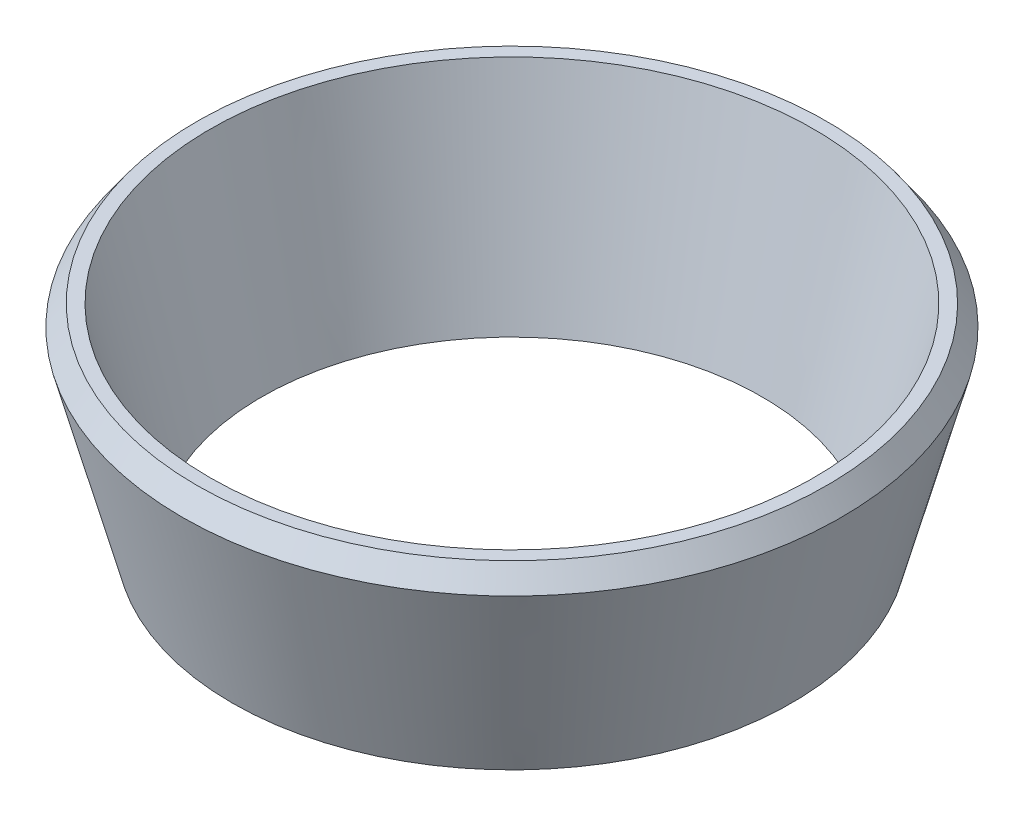
ISO-10303-21;
HEADER;
FILE_DESCRIPTION(('STEP AP214'),'2;1');
FILE_NAME('part.step','',(''),(''),'','','');
FILE_SCHEMA(('AUTOMOTIVE_DESIGN { 1 0 10303 214 1 1 1 1 }'));
ENDSEC;
DATA;
#1=APPLICATION_CONTEXT('core data for automotive mechanical design processes');
#2=APPLICATION_PROTOCOL_DEFINITION('international standard','automotive_design',2000,#1);
#3=PRODUCT_CONTEXT('',#1,'mechanical');
#4=PRODUCT('Part','Part','',(#3));
#5=PRODUCT_RELATED_PRODUCT_CATEGORY('part','',(#4));
#6=PRODUCT_DEFINITION_FORMATION('','',#4);
#7=PRODUCT_DEFINITION_CONTEXT('part definition',#1,'design');
#8=PRODUCT_DEFINITION('design','',#6,#7);
#9=PRODUCT_DEFINITION_SHAPE('','',#8);
#10=(LENGTH_UNIT() NAMED_UNIT(*) SI_UNIT(.MILLI.,.METRE.));
#11=(NAMED_UNIT(*) PLANE_ANGLE_UNIT() SI_UNIT($,.RADIAN.));
#12=(NAMED_UNIT(*) SI_UNIT($,.STERADIAN.) SOLID_ANGLE_UNIT());
#13=UNCERTAINTY_MEASURE_WITH_UNIT(LENGTH_MEASURE(1.E-05),#10,'distance_accuracy_value','');
#14=(GEOMETRIC_REPRESENTATION_CONTEXT(3) GLOBAL_UNCERTAINTY_ASSIGNED_CONTEXT((#13)) GLOBAL_UNIT_ASSIGNED_CONTEXT((#10,
#11,#12)) REPRESENTATION_CONTEXT('',''));
#15=CARTESIAN_POINT('',(0.,0.,0.));
#16=DIRECTION('',(0.,0.,1.));
#17=DIRECTION('',(1.,0.,0.));
#18=AXIS2_PLACEMENT_3D('',#15,#16,#17);
#19=CARTESIAN_POINT('',(0.,0.757981005057098,0.));
#20=DIRECTION('',(0.,1.,0.));
#21=DIRECTION('',(0.,0.,1.));
#22=AXIS2_PLACEMENT_3D('',#19,#20,#21);
#23=CONICAL_SURFACE('',#22,22.3793242712695,0.261826880319574);
#24=CARTESIAN_POINT('',(0.,-11.8524420910968,0.));
#25=DIRECTION('',(0.,1.,0.));
#26=DIRECTION('',(0.,0.,1.));
#27=AXIS2_PLACEMENT_3D('',#24,#25,#26);
#28=CIRCLE('',#27,19.);
#29=CARTESIAN_POINT('',(0.,-11.8524420910968,19.));
#30=VERTEX_POINT('',#29);
#31=EDGE_CURVE('E56',#30,#30,#28,.T.);
#32=ORIENTED_EDGE('',*,*,#31,.T.);
#33=EDGE_LOOP('',(#32));
#34=FACE_BOUND('',#33,.T.);
#35=CARTESIAN_POINT('',(0.,0.757981005057098,0.));
#36=DIRECTION('',(0.,1.,0.));
#37=DIRECTION('',(0.,0.,1.));
#38=AXIS2_PLACEMENT_3D('',#35,#36,#37);
#39=CIRCLE('',#38,22.3793242712695);
#40=CARTESIAN_POINT('',(0.,0.757981005057098,22.3793242712695));
#41=VERTEX_POINT('',#40);
#42=EDGE_CURVE('E10',#41,#41,#39,.T.);
#43=ORIENTED_EDGE('',*,*,#42,.F.);
#44=EDGE_LOOP('',(#43));
#45=FACE_BOUND('',#44,.T.);
#46=ADVANCED_FACE('F37',(#34,#45),#23,.T.);
#47=CARTESIAN_POINT('',(0.,2.14755790890321,0.));
#48=DIRECTION('',(0.,-1.,0.));
#49=DIRECTION('',(0.,0.,-1.));
#50=AXIS2_PLACEMENT_3D('',#47,#48,#49);
#51=CONICAL_SURFACE('',#50,21.4,0.613916366631105);
#52=ORIENTED_EDGE('',*,*,#42,.T.);
#53=EDGE_LOOP('',(#52));
#54=FACE_BOUND('',#53,.T.);
#55=CARTESIAN_POINT('',(0.,2.14755790890321,0.));
#56=DIRECTION('',(0.,1.,0.));
#57=DIRECTION('',(0.,0.,1.));
#58=AXIS2_PLACEMENT_3D('',#55,#56,#57);
#59=CIRCLE('',#58,21.4);
#60=CARTESIAN_POINT('',(0.,2.14755790890321,21.4));
#61=VERTEX_POINT('',#60);
#62=EDGE_CURVE('E43',#61,#61,#59,.T.);
#63=ORIENTED_EDGE('',*,*,#62,.F.);
#64=EDGE_LOOP('',(#63));
#65=FACE_BOUND('',#64,.T.);
#66=ADVANCED_FACE('F76',(#54,#65),#51,.T.);
#67=CARTESIAN_POINT('',(0.,2.14755790890321,0.));
#68=DIRECTION('',(0.,1.,0.));
#69=DIRECTION('',(0.,0.,1.));
#70=AXIS2_PLACEMENT_3D('',#67,#68,#69);
#71=PLANE('',#70);
#72=ORIENTED_EDGE('',*,*,#62,.T.);
#73=EDGE_LOOP('',(#72));
#74=FACE_BOUND('',#73,.T.);
#75=CARTESIAN_POINT('',(0.,2.14755790890321,0.));
#76=DIRECTION('',(0.,1.,0.));
#77=DIRECTION('',(0.,0.,1.));
#78=AXIS2_PLACEMENT_3D('',#75,#76,#77);
#79=CIRCLE('',#78,20.5);
#80=CARTESIAN_POINT('',(0.,2.14755790890321,20.5));
#81=VERTEX_POINT('',#80);
#82=EDGE_CURVE('E47',#81,#81,#79,.T.);
#83=ORIENTED_EDGE('',*,*,#82,.F.);
#84=EDGE_LOOP('',(#83));
#85=FACE_BOUND('',#84,.T.);
#86=ADVANCED_FACE('F71',(#74,#85),#71,.T.);
#87=CARTESIAN_POINT('',(0.,2.14755790890321,0.));
#88=DIRECTION('',(0.,1.,0.));
#89=DIRECTION('',(0.,0.,1.));
#90=AXIS2_PLACEMENT_3D('',#87,#88,#89);
#91=CONICAL_SURFACE('',#90,20.5,0.244978663126868);
#92=CARTESIAN_POINT('',(0.,-11.8524420910966,0.));
#93=DIRECTION('',(0.,1.,0.));
#94=DIRECTION('',(0.,0.,1.));
#95=AXIS2_PLACEMENT_3D('',#92,#93,#94);
#96=CIRCLE('',#95,17.);
#97=CARTESIAN_POINT('',(0.,-11.8524420910966,17.));
#98=VERTEX_POINT('',#97);
#99=EDGE_CURVE('E51',#98,#98,#96,.T.);
#100=ORIENTED_EDGE('',*,*,#99,.F.);
#101=EDGE_LOOP('',(#100));
#102=FACE_BOUND('',#101,.T.);
#103=ORIENTED_EDGE('',*,*,#82,.T.);
#104=EDGE_LOOP('',(#103));
#105=FACE_BOUND('',#104,.T.);
#106=ADVANCED_FACE('F65',(#102,#105),#91,.F.);
#107=CARTESIAN_POINT('',(-1.39812824892926E-12,-11.8524420910967,0.));
#108=DIRECTION('',(0.,1.,0.));
#109=DIRECTION('',(0.,0.,1.));
#110=AXIS2_PLACEMENT_3D('',#107,#108,#109);
#111=PLANE('',#110);
#112=ORIENTED_EDGE('',*,*,#31,.F.);
#113=EDGE_LOOP('',(#112));
#114=FACE_BOUND('',#113,.T.);
#115=ORIENTED_EDGE('',*,*,#99,.T.);
#116=EDGE_LOOP('',(#115));
#117=FACE_BOUND('',#116,.T.);
#118=ADVANCED_FACE('F62',(#114,#117),#111,.F.);
#119=CLOSED_SHELL('',(#46,#66,#86,#106,#118));
#120=MANIFOLD_SOLID_BREP('B2',#119);
#121=ADVANCED_BREP_SHAPE_REPRESENTATION('',(#18,#120),#14);
#122=SHAPE_DEFINITION_REPRESENTATION(#9,#121);
ENDSEC;
END-ISO-10303-21;
